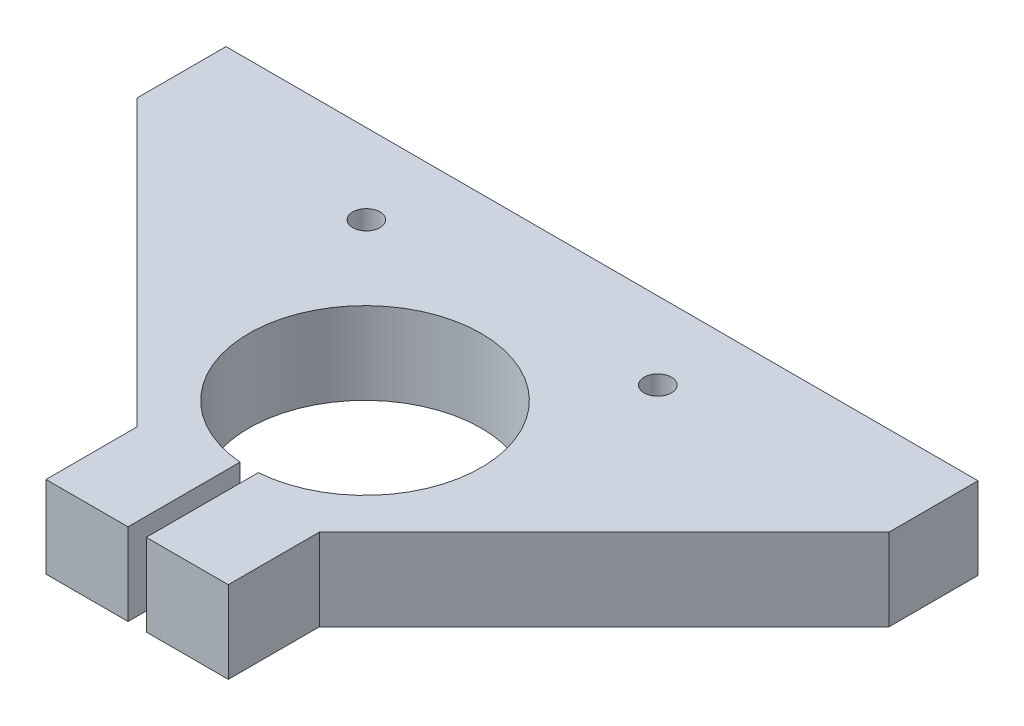
ISO-10303-21;
HEADER;
FILE_DESCRIPTION(('STEP AP214'),'2;1');
FILE_NAME('part.step','',(''),(''),'','','');
FILE_SCHEMA(('AUTOMOTIVE_DESIGN { 1 0 10303 214 1 1 1 1 }'));
ENDSEC;
DATA;
#1=APPLICATION_CONTEXT('core data for automotive mechanical design processes');
#2=APPLICATION_PROTOCOL_DEFINITION('international standard','automotive_design',2000,#1);
#3=PRODUCT_CONTEXT('',#1,'mechanical');
#4=PRODUCT('Part','Part','',(#3));
#5=PRODUCT_RELATED_PRODUCT_CATEGORY('part','',(#4));
#6=PRODUCT_DEFINITION_FORMATION('','',#4);
#7=PRODUCT_DEFINITION_CONTEXT('part definition',#1,'design');
#8=PRODUCT_DEFINITION('design','',#6,#7);
#9=PRODUCT_DEFINITION_SHAPE('','',#8);
#10=(LENGTH_UNIT() NAMED_UNIT(*) SI_UNIT(.MILLI.,.METRE.));
#11=(NAMED_UNIT(*) PLANE_ANGLE_UNIT() SI_UNIT($,.RADIAN.));
#12=(NAMED_UNIT(*) SI_UNIT($,.STERADIAN.) SOLID_ANGLE_UNIT());
#13=UNCERTAINTY_MEASURE_WITH_UNIT(LENGTH_MEASURE(1.E-05),#10,'distance_accuracy_value','');
#14=(GEOMETRIC_REPRESENTATION_CONTEXT(3) GLOBAL_UNCERTAINTY_ASSIGNED_CONTEXT((#13)) GLOBAL_UNIT_ASSIGNED_CONTEXT((#10,
#11,#12)) REPRESENTATION_CONTEXT('',''));
#15=CARTESIAN_POINT('',(0.,0.,0.));
#16=DIRECTION('',(0.,0.,1.));
#17=DIRECTION('',(1.,0.,0.));
#18=AXIS2_PLACEMENT_3D('',#15,#16,#17);
#19=CARTESIAN_POINT('',(-0.62482485548284,18.,40.2736793553215));
#20=DIRECTION('',(0.,-1.,0.));
#21=DIRECTION('',(0.,0.,-1.));
#22=AXIS2_PLACEMENT_3D('',#19,#20,#21);
#23=CYLINDRICAL_SURFACE('',#22,25.5);
#24=CARTESIAN_POINT('',(-0.62482485548284,0.,40.2736793553215));
#25=DIRECTION('',(0.,-1.,0.));
#26=DIRECTION('',(0.,0.,1.));
#27=AXIS2_PLACEMENT_3D('',#24,#25,#26);
#28=CIRCLE('',#27,25.5);
#29=CARTESIAN_POINT('',(-2.62482485548284,0.,65.6951269930938));
#30=VERTEX_POINT('',#29);
#31=CARTESIAN_POINT('',(1.37517514451716,0.,65.6951269930938));
#32=VERTEX_POINT('',#31);
#33=EDGE_CURVE('E154',#30,#32,#28,.T.);
#34=ORIENTED_EDGE('',*,*,#33,.T.);
#35=DIRECTION('',(0.,-1.,0.));
#36=VECTOR('',#35,1.);
#37=CARTESIAN_POINT('',(1.37517514451716,18.,65.6951269930938));
#38=LINE('',#37,#36);
#39=CARTESIAN_POINT('',(1.37517514451716,18.,65.6951269930938));
#40=VERTEX_POINT('',#39);
#41=EDGE_CURVE('E11',#40,#32,#38,.T.);
#42=ORIENTED_EDGE('',*,*,#41,.F.);
#43=CARTESIAN_POINT('',(-0.62482485548284,18.,40.2736793553215));
#44=DIRECTION('',(0.,-1.,0.));
#45=DIRECTION('',(0.,0.,1.));
#46=AXIS2_PLACEMENT_3D('',#43,#44,#45);
#47=CIRCLE('',#46,25.5);
#48=CARTESIAN_POINT('',(-2.62482485548284,18.,65.6951269930938));
#49=VERTEX_POINT('',#48);
#50=EDGE_CURVE('E177',#49,#40,#47,.T.);
#51=ORIENTED_EDGE('',*,*,#50,.F.);
#52=DIRECTION('',(0.,-1.,0.));
#53=VECTOR('',#52,1.);
#54=CARTESIAN_POINT('',(-2.62482485548284,18.,65.6951269930938));
#55=LINE('',#54,#53);
#56=EDGE_CURVE('E150',#49,#30,#55,.T.);
#57=ORIENTED_EDGE('',*,*,#56,.T.);
#58=EDGE_LOOP('',(#34,#42,#51,#57));
#59=FACE_BOUND('',#58,.T.);
#60=ADVANCED_FACE('F34',(#59),#23,.F.);
#61=CARTESIAN_POINT('',(1.37517514451716,18.,90.2736793553215));
#62=DIRECTION('',(1.,0.,0.));
#63=DIRECTION('',(0.,0.,-1.));
#64=AXIS2_PLACEMENT_3D('',#61,#62,#63);
#65=PLANE('',#64);
#66=DIRECTION('',(0.,0.,1.));
#67=VECTOR('',#66,1.);
#68=CARTESIAN_POINT('',(1.37517514451716,0.,90.2736793553215));
#69=LINE('',#68,#67);
#70=CARTESIAN_POINT('',(1.37517514451716,0.,90.2736793553215));
#71=VERTEX_POINT('',#70);
#72=EDGE_CURVE('E157',#32,#71,#69,.T.);
#73=ORIENTED_EDGE('',*,*,#72,.T.);
#74=DIRECTION('',(0.,-1.,0.));
#75=VECTOR('',#74,1.);
#76=CARTESIAN_POINT('',(1.37517514451716,18.,90.2736793553215));
#77=LINE('',#76,#75);
#78=CARTESIAN_POINT('',(1.37517514451716,18.,90.2736793553215));
#79=VERTEX_POINT('',#78);
#80=EDGE_CURVE('E42',#79,#71,#77,.T.);
#81=ORIENTED_EDGE('',*,*,#80,.F.);
#82=DIRECTION('',(0.,0.,1.));
#83=VECTOR('',#82,1.);
#84=CARTESIAN_POINT('',(1.37517514451716,18.,90.2736793553215));
#85=LINE('',#84,#83);
#86=EDGE_CURVE('E105',#40,#79,#85,.T.);
#87=ORIENTED_EDGE('',*,*,#86,.F.);
#88=ORIENTED_EDGE('',*,*,#41,.T.);
#89=EDGE_LOOP('',(#73,#81,#87,#88));
#90=FACE_BOUND('',#89,.T.);
#91=ADVANCED_FACE('F256',(#90),#65,.F.);
#92=CARTESIAN_POINT('',(1.37517514451716,18.,90.2736793553215));
#93=DIRECTION('',(0.,0.,-1.));
#94=DIRECTION('',(-1.,0.,0.));
#95=AXIS2_PLACEMENT_3D('',#92,#93,#94);
#96=PLANE('',#95);
#97=DIRECTION('',(1.,0.,0.));
#98=VECTOR('',#97,1.);
#99=CARTESIAN_POINT('',(1.37517514451716,0.,90.2736793553215));
#100=LINE('',#99,#98);
#101=CARTESIAN_POINT('',(19.375175144517,0.,90.2736793553215));
#102=VERTEX_POINT('',#101);
#103=EDGE_CURVE('E160',#71,#102,#100,.T.);
#104=ORIENTED_EDGE('',*,*,#103,.T.);
#105=DIRECTION('',(0.,-1.,0.));
#106=VECTOR('',#105,1.);
#107=CARTESIAN_POINT('',(19.375175144517,18.,90.2736793553215));
#108=LINE('',#107,#106);
#109=CARTESIAN_POINT('',(19.375175144517,18.,90.2736793553215));
#110=VERTEX_POINT('',#109);
#111=EDGE_CURVE('E196',#110,#102,#108,.T.);
#112=ORIENTED_EDGE('',*,*,#111,.F.);
#113=DIRECTION('',(1.,0.,0.));
#114=VECTOR('',#113,1.);
#115=CARTESIAN_POINT('',(1.37517514451716,18.,90.2736793553215));
#116=LINE('',#115,#114);
#117=EDGE_CURVE('E204',#79,#110,#116,.T.);
#118=ORIENTED_EDGE('',*,*,#117,.F.);
#119=ORIENTED_EDGE('',*,*,#80,.T.);
#120=EDGE_LOOP('',(#104,#112,#118,#119));
#121=FACE_BOUND('',#120,.T.);
#122=ADVANCED_FACE('F202',(#121),#96,.F.);
#123=CARTESIAN_POINT('',(19.375175144517,18.,70.2736793553218));
#124=DIRECTION('',(-1.,0.,0.));
#125=DIRECTION('',(0.,0.,1.));
#126=AXIS2_PLACEMENT_3D('',#123,#124,#125);
#127=PLANE('',#126);
#128=DIRECTION('',(0.,0.,-1.));
#129=VECTOR('',#128,1.);
#130=CARTESIAN_POINT('',(19.375175144517,0.,70.2736793553218));
#131=LINE('',#130,#129);
#132=CARTESIAN_POINT('',(19.375175144517,0.,70.2736793553218));
#133=VERTEX_POINT('',#132);
#134=EDGE_CURVE('E162',#102,#133,#131,.T.);
#135=ORIENTED_EDGE('',*,*,#134,.T.);
#136=DIRECTION('',(0.,-1.,0.));
#137=VECTOR('',#136,1.);
#138=CARTESIAN_POINT('',(19.375175144517,18.,70.2736793553218));
#139=LINE('',#138,#137);
#140=CARTESIAN_POINT('',(19.375175144517,18.,70.2736793553218));
#141=VERTEX_POINT('',#140);
#142=EDGE_CURVE('E193',#141,#133,#139,.T.);
#143=ORIENTED_EDGE('',*,*,#142,.F.);
#144=DIRECTION('',(0.,0.,-1.));
#145=VECTOR('',#144,1.);
#146=CARTESIAN_POINT('',(19.375175144517,18.,70.2736793553218));
#147=LINE('',#146,#145);
#148=EDGE_CURVE('E222',#110,#141,#147,.T.);
#149=ORIENTED_EDGE('',*,*,#148,.F.);
#150=ORIENTED_EDGE('',*,*,#111,.T.);
#151=EDGE_LOOP('',(#135,#143,#149,#150));
#152=FACE_BOUND('',#151,.T.);
#153=ADVANCED_FACE('F213',(#152),#127,.F.);
#154=CARTESIAN_POINT('',(19.375175144517,18.,70.2736793553218));
#155=DIRECTION('',(-0.707106781186547,0.,-0.707106781186548));
#156=DIRECTION('',(-0.707106781186548,0.,0.707106781186547));
#157=AXIS2_PLACEMENT_3D('',#154,#155,#156);
#158=PLANE('',#157);
#159=DIRECTION('',(0.707106781186548,0.,-0.707106781186547));
#160=VECTOR('',#159,1.);
#161=CARTESIAN_POINT('',(19.375175144517,0.,70.2736793553218));
#162=LINE('',#161,#160);
#163=CARTESIAN_POINT('',(81.8751751445169,0.,7.77367935532188));
#164=VERTEX_POINT('',#163);
#165=EDGE_CURVE('E164',#133,#164,#162,.T.);
#166=ORIENTED_EDGE('',*,*,#165,.T.);
#167=DIRECTION('',(0.,-1.,0.));
#168=VECTOR('',#167,1.);
#169=CARTESIAN_POINT('',(81.8751751445169,18.,7.77367935532188));
#170=LINE('',#169,#168);
#171=CARTESIAN_POINT('',(81.8751751445169,18.,7.77367935532188));
#172=VERTEX_POINT('',#171);
#173=EDGE_CURVE('E190',#172,#164,#170,.T.);
#174=ORIENTED_EDGE('',*,*,#173,.F.);
#175=DIRECTION('',(0.707106781186548,0.,-0.707106781186547));
#176=VECTOR('',#175,1.);
#177=CARTESIAN_POINT('',(19.375175144517,18.,70.2736793553218));
#178=LINE('',#177,#176);
#179=EDGE_CURVE('E219',#141,#172,#178,.T.);
#180=ORIENTED_EDGE('',*,*,#179,.F.);
#181=ORIENTED_EDGE('',*,*,#142,.T.);
#182=EDGE_LOOP('',(#166,#174,#180,#181));
#183=FACE_BOUND('',#182,.T.);
#184=ADVANCED_FACE('F217',(#183),#158,.F.);
#185=CARTESIAN_POINT('',(81.8751751445169,18.,-11.7263206446789));
#186=DIRECTION('',(-1.,0.,0.));
#187=DIRECTION('',(0.,0.,1.));
#188=AXIS2_PLACEMENT_3D('',#185,#186,#187);
#189=PLANE('',#188);
#190=DIRECTION('',(0.,0.,-1.));
#191=VECTOR('',#190,1.);
#192=CARTESIAN_POINT('',(81.8751751445169,0.,-11.7263206446789));
#193=LINE('',#192,#191);
#194=CARTESIAN_POINT('',(81.8751751445169,0.,-11.7263206446789));
#195=VERTEX_POINT('',#194);
#196=EDGE_CURVE('E166',#164,#195,#193,.T.);
#197=ORIENTED_EDGE('',*,*,#196,.T.);
#198=DIRECTION('',(0.,-1.,0.));
#199=VECTOR('',#198,1.);
#200=CARTESIAN_POINT('',(81.8751751445169,18.,-11.7263206446789));
#201=LINE('',#200,#199);
#202=CARTESIAN_POINT('',(81.8751751445169,18.,-11.7263206446789));
#203=VERTEX_POINT('',#202);
#204=EDGE_CURVE('E187',#203,#195,#201,.T.);
#205=ORIENTED_EDGE('',*,*,#204,.F.);
#206=DIRECTION('',(0.,0.,-1.));
#207=VECTOR('',#206,1.);
#208=CARTESIAN_POINT('',(81.8751751445169,18.,-11.7263206446789));
#209=LINE('',#208,#207);
#210=EDGE_CURVE('E221',#172,#203,#209,.T.);
#211=ORIENTED_EDGE('',*,*,#210,.F.);
#212=ORIENTED_EDGE('',*,*,#173,.T.);
#213=EDGE_LOOP('',(#197,#205,#211,#212));
#214=FACE_BOUND('',#213,.T.);
#215=ADVANCED_FACE('F269',(#214),#189,.F.);
#216=CARTESIAN_POINT('',(-83.1248248554831,18.,-11.7263206446788));
#217=DIRECTION('',(0.,0.,1.));
#218=DIRECTION('',(1.,0.,0.));
#219=AXIS2_PLACEMENT_3D('',#216,#217,#218);
#220=PLANE('',#219);
#221=DIRECTION('',(-1.,0.,0.));
#222=VECTOR('',#221,1.);
#223=CARTESIAN_POINT('',(-83.1248248554831,0.,-11.7263206446788));
#224=LINE('',#223,#222);
#225=CARTESIAN_POINT('',(-83.1248248554831,0.,-11.7263206446788));
#226=VERTEX_POINT('',#225);
#227=EDGE_CURVE('E168',#195,#226,#224,.T.);
#228=ORIENTED_EDGE('',*,*,#227,.T.);
#229=DIRECTION('',(0.,-1.,0.));
#230=VECTOR('',#229,1.);
#231=CARTESIAN_POINT('',(-83.1248248554831,18.,-11.7263206446788));
#232=LINE('',#231,#230);
#233=CARTESIAN_POINT('',(-83.1248248554831,18.,-11.7263206446788));
#234=VERTEX_POINT('',#233);
#235=EDGE_CURVE('E184',#234,#226,#232,.T.);
#236=ORIENTED_EDGE('',*,*,#235,.F.);
#237=DIRECTION('',(-1.,0.,0.));
#238=VECTOR('',#237,1.);
#239=CARTESIAN_POINT('',(-83.1248248554831,18.,-11.7263206446788));
#240=LINE('',#239,#238);
#241=EDGE_CURVE('E224',#203,#234,#240,.T.);
#242=ORIENTED_EDGE('',*,*,#241,.F.);
#243=ORIENTED_EDGE('',*,*,#204,.T.);
#244=EDGE_LOOP('',(#228,#236,#242,#243));
#245=FACE_BOUND('',#244,.T.);
#246=ADVANCED_FACE('F272',(#245),#220,.F.);
#247=CARTESIAN_POINT('',(-83.1248248554831,18.,-11.7263206446788));
#248=DIRECTION('',(1.,0.,0.));
#249=DIRECTION('',(0.,0.,-1.));
#250=AXIS2_PLACEMENT_3D('',#247,#248,#249);
#251=PLANE('',#250);
#252=DIRECTION('',(0.,0.,1.));
#253=VECTOR('',#252,1.);
#254=CARTESIAN_POINT('',(-83.1248248554831,0.,-11.7263206446788));
#255=LINE('',#254,#253);
#256=CARTESIAN_POINT('',(-83.1248248554831,0.,7.77367935532199));
#257=VERTEX_POINT('',#256);
#258=EDGE_CURVE('E170',#226,#257,#255,.T.);
#259=ORIENTED_EDGE('',*,*,#258,.T.);
#260=DIRECTION('',(0.,-1.,0.));
#261=VECTOR('',#260,1.);
#262=CARTESIAN_POINT('',(-83.1248248554831,18.,7.77367935532199));
#263=LINE('',#262,#261);
#264=CARTESIAN_POINT('',(-83.1248248554831,18.,7.77367935532199));
#265=VERTEX_POINT('',#264);
#266=EDGE_CURVE('E181',#265,#257,#263,.T.);
#267=ORIENTED_EDGE('',*,*,#266,.F.);
#268=DIRECTION('',(0.,0.,1.));
#269=VECTOR('',#268,1.);
#270=CARTESIAN_POINT('',(-83.1248248554831,18.,-11.7263206446788));
#271=LINE('',#270,#269);
#272=EDGE_CURVE('E230',#234,#265,#271,.T.);
#273=ORIENTED_EDGE('',*,*,#272,.F.);
#274=ORIENTED_EDGE('',*,*,#235,.T.);
#275=EDGE_LOOP('',(#259,#267,#273,#274));
#276=FACE_BOUND('',#275,.T.);
#277=ADVANCED_FACE('F236',(#276),#251,.F.);
#278=CARTESIAN_POINT('',(-83.1248248554831,18.,7.77367935532199));
#279=DIRECTION('',(0.707106781186543,0.,-0.707106781186552));
#280=DIRECTION('',(-0.707106781186552,0.,-0.707106781186543));
#281=AXIS2_PLACEMENT_3D('',#278,#279,#280);
#282=PLANE('',#281);
#283=DIRECTION('',(0.707106781186552,0.,0.707106781186543));
#284=VECTOR('',#283,1.);
#285=CARTESIAN_POINT('',(-83.1248248554831,0.,7.77367935532199));
#286=LINE('',#285,#284);
#287=CARTESIAN_POINT('',(-20.6248248554827,0.,70.2736793553215));
#288=VERTEX_POINT('',#287);
#289=EDGE_CURVE('E172',#257,#288,#286,.T.);
#290=ORIENTED_EDGE('',*,*,#289,.T.);
#291=DIRECTION('',(0.,-1.,0.));
#292=VECTOR('',#291,1.);
#293=CARTESIAN_POINT('',(-20.6248248554827,18.,70.2736793553215));
#294=LINE('',#293,#292);
#295=CARTESIAN_POINT('',(-20.6248248554827,18.,70.2736793553215));
#296=VERTEX_POINT('',#295);
#297=EDGE_CURVE('E145',#296,#288,#294,.T.);
#298=ORIENTED_EDGE('',*,*,#297,.F.);
#299=DIRECTION('',(0.707106781186552,0.,0.707106781186543));
#300=VECTOR('',#299,1.);
#301=CARTESIAN_POINT('',(-83.1248248554831,18.,7.77367935532199));
#302=LINE('',#301,#300);
#303=EDGE_CURVE('E136',#265,#296,#302,.T.);
#304=ORIENTED_EDGE('',*,*,#303,.F.);
#305=ORIENTED_EDGE('',*,*,#266,.T.);
#306=EDGE_LOOP('',(#290,#298,#304,#305));
#307=FACE_BOUND('',#306,.T.);
#308=ADVANCED_FACE('F240',(#307),#282,.F.);
#309=CARTESIAN_POINT('',(-20.6248248554827,18.,70.2736793553215));
#310=DIRECTION('',(1.,0.,0.));
#311=DIRECTION('',(0.,0.,-1.));
#312=AXIS2_PLACEMENT_3D('',#309,#310,#311);
#313=PLANE('',#312);
#314=DIRECTION('',(0.,0.,1.));
#315=VECTOR('',#314,1.);
#316=CARTESIAN_POINT('',(-20.6248248554827,0.,70.2736793553215));
#317=LINE('',#316,#315);
#318=CARTESIAN_POINT('',(-20.6248248554828,0.,90.2736793553215));
#319=VERTEX_POINT('',#318);
#320=EDGE_CURVE('E144',#288,#319,#317,.T.);
#321=ORIENTED_EDGE('',*,*,#320,.T.);
#322=DIRECTION('',(0.,-1.,0.));
#323=VECTOR('',#322,1.);
#324=CARTESIAN_POINT('',(-20.6248248554828,18.,90.2736793553215));
#325=LINE('',#324,#323);
#326=CARTESIAN_POINT('',(-20.6248248554828,18.,90.2736793553215));
#327=VERTEX_POINT('',#326);
#328=EDGE_CURVE('E141',#327,#319,#325,.T.);
#329=ORIENTED_EDGE('',*,*,#328,.F.);
#330=DIRECTION('',(0.,0.,1.));
#331=VECTOR('',#330,1.);
#332=CARTESIAN_POINT('',(-20.6248248554827,18.,70.2736793553215));
#333=LINE('',#332,#331);
#334=EDGE_CURVE('E130',#296,#327,#333,.T.);
#335=ORIENTED_EDGE('',*,*,#334,.F.);
#336=ORIENTED_EDGE('',*,*,#297,.T.);
#337=EDGE_LOOP('',(#321,#329,#335,#336));
#338=FACE_BOUND('',#337,.T.);
#339=ADVANCED_FACE('F142',(#338),#313,.F.);
#340=CARTESIAN_POINT('',(-20.6248248554828,18.,90.2736793553215));
#341=DIRECTION('',(0.,0.,-1.));
#342=DIRECTION('',(-1.,0.,0.));
#343=AXIS2_PLACEMENT_3D('',#340,#341,#342);
#344=PLANE('',#343);
#345=DIRECTION('',(1.,0.,0.));
#346=VECTOR('',#345,1.);
#347=CARTESIAN_POINT('',(-20.6248248554828,0.,90.2736793553215));
#348=LINE('',#347,#346);
#349=CARTESIAN_POINT('',(-2.62482485548284,0.,90.2736793553215));
#350=VERTEX_POINT('',#349);
#351=EDGE_CURVE('E91',#319,#350,#348,.T.);
#352=ORIENTED_EDGE('',*,*,#351,.T.);
#353=DIRECTION('',(0.,-1.,0.));
#354=VECTOR('',#353,1.);
#355=CARTESIAN_POINT('',(-2.62482485548284,18.,90.2736793553215));
#356=LINE('',#355,#354);
#357=CARTESIAN_POINT('',(-2.62482485548284,18.,90.2736793553215));
#358=VERTEX_POINT('',#357);
#359=EDGE_CURVE('E146',#358,#350,#356,.T.);
#360=ORIENTED_EDGE('',*,*,#359,.F.);
#361=DIRECTION('',(1.,0.,0.));
#362=VECTOR('',#361,1.);
#363=CARTESIAN_POINT('',(-20.6248248554828,18.,90.2736793553215));
#364=LINE('',#363,#362);
#365=EDGE_CURVE('E134',#327,#358,#364,.T.);
#366=ORIENTED_EDGE('',*,*,#365,.F.);
#367=ORIENTED_EDGE('',*,*,#328,.T.);
#368=EDGE_LOOP('',(#352,#360,#366,#367));
#369=FACE_BOUND('',#368,.T.);
#370=ADVANCED_FACE('F148',(#369),#344,.F.);
#371=CARTESIAN_POINT('',(-2.62482485548284,18.,90.2736793553215));
#372=DIRECTION('',(-1.,0.,0.));
#373=DIRECTION('',(0.,0.,1.));
#374=AXIS2_PLACEMENT_3D('',#371,#372,#373);
#375=PLANE('',#374);
#376=DIRECTION('',(0.,0.,-1.));
#377=VECTOR('',#376,1.);
#378=CARTESIAN_POINT('',(-2.62482485548284,0.,90.2736793553215));
#379=LINE('',#378,#377);
#380=EDGE_CURVE('E97',#350,#30,#379,.T.);
#381=ORIENTED_EDGE('',*,*,#380,.T.);
#382=ORIENTED_EDGE('',*,*,#56,.F.);
#383=DIRECTION('',(0.,0.,-1.));
#384=VECTOR('',#383,1.);
#385=CARTESIAN_POINT('',(-2.62482485548284,18.,90.2736793553215));
#386=LINE('',#385,#384);
#387=EDGE_CURVE('E50',#358,#49,#386,.T.);
#388=ORIENTED_EDGE('',*,*,#387,.F.);
#389=ORIENTED_EDGE('',*,*,#359,.T.);
#390=EDGE_LOOP('',(#381,#382,#388,#389));
#391=FACE_BOUND('',#390,.T.);
#392=ADVANCED_FACE('F244',(#391),#375,.F.);
#393=CARTESIAN_POINT('',(-0.62482485548284,18.,40.2736793553215));
#394=DIRECTION('',(0.,1.,0.));
#395=DIRECTION('',(0.,0.,1.));
#396=AXIS2_PLACEMENT_3D('',#393,#394,#395);
#397=PLANE('',#396);
#398=CARTESIAN_POINT('',(-34.8169284840513,18.,5.785627569099));
#399=DIRECTION('',(0.,1.,0.));
#400=DIRECTION('',(0.,0.,1.));
#401=AXIS2_PLACEMENT_3D('',#398,#399,#400);
#402=CIRCLE('',#401,2.99999999999999);
#403=CARTESIAN_POINT('',(-34.8169284840513,18.,8.78562756909899));
#404=VERTEX_POINT('',#403);
#405=EDGE_CURVE('E340',#404,#404,#402,.T.);
#406=ORIENTED_EDGE('',*,*,#405,.F.);
#407=EDGE_LOOP('',(#406));
#408=FACE_BOUND('',#407,.T.);
#409=CARTESIAN_POINT('',(28.5542290037577,18.,5.21642555573545));
#410=DIRECTION('',(0.,1.,0.));
#411=DIRECTION('',(0.,0.,1.));
#412=AXIS2_PLACEMENT_3D('',#409,#410,#411);
#413=CIRCLE('',#412,2.99999999999999);
#414=CARTESIAN_POINT('',(28.5542290037577,18.,8.21642555573544));
#415=VERTEX_POINT('',#414);
#416=EDGE_CURVE('E342',#415,#415,#413,.T.);
#417=ORIENTED_EDGE('',*,*,#416,.F.);
#418=EDGE_LOOP('',(#417));
#419=FACE_BOUND('',#418,.T.);
#420=ORIENTED_EDGE('',*,*,#50,.T.);
#421=ORIENTED_EDGE('',*,*,#86,.T.);
#422=ORIENTED_EDGE('',*,*,#117,.T.);
#423=ORIENTED_EDGE('',*,*,#148,.T.);
#424=ORIENTED_EDGE('',*,*,#179,.T.);
#425=ORIENTED_EDGE('',*,*,#210,.T.);
#426=ORIENTED_EDGE('',*,*,#241,.T.);
#427=ORIENTED_EDGE('',*,*,#272,.T.);
#428=ORIENTED_EDGE('',*,*,#303,.T.);
#429=ORIENTED_EDGE('',*,*,#334,.T.);
#430=ORIENTED_EDGE('',*,*,#365,.T.);
#431=ORIENTED_EDGE('',*,*,#387,.T.);
#432=EDGE_LOOP('',(#420,#421,#422,#423,#424,#425,#426,#427,#428,#429,#430,#431));
#433=FACE_BOUND('',#432,.T.);
#434=ADVANCED_FACE('F132',(#408,#419,#433),#397,.T.);
#435=CARTESIAN_POINT('',(-0.62482485548284,0.,40.2736793553215));
#436=DIRECTION('',(0.,1.,0.));
#437=DIRECTION('',(0.,0.,1.));
#438=AXIS2_PLACEMENT_3D('',#435,#436,#437);
#439=PLANE('',#438);
#440=CARTESIAN_POINT('',(-34.8169284840513,0.,5.785627569099));
#441=DIRECTION('',(0.,1.,0.));
#442=DIRECTION('',(0.,0.,1.));
#443=AXIS2_PLACEMENT_3D('',#440,#441,#442);
#444=CIRCLE('',#443,3.);
#445=CARTESIAN_POINT('',(-34.8169284840513,0.,8.785627569099));
#446=VERTEX_POINT('',#445);
#447=EDGE_CURVE('E337',#446,#446,#444,.T.);
#448=ORIENTED_EDGE('',*,*,#447,.T.);
#449=EDGE_LOOP('',(#448));
#450=FACE_BOUND('',#449,.T.);
#451=CARTESIAN_POINT('',(28.5542290037577,0.,5.21642555573545));
#452=DIRECTION('',(0.,1.,0.));
#453=DIRECTION('',(0.,0.,1.));
#454=AXIS2_PLACEMENT_3D('',#451,#452,#453);
#455=CIRCLE('',#454,3.);
#456=CARTESIAN_POINT('',(28.5542290037577,0.,8.21642555573545));
#457=VERTEX_POINT('',#456);
#458=EDGE_CURVE('E158',#457,#457,#455,.T.);
#459=ORIENTED_EDGE('',*,*,#458,.T.);
#460=EDGE_LOOP('',(#459));
#461=FACE_BOUND('',#460,.T.);
#462=ORIENTED_EDGE('',*,*,#33,.F.);
#463=ORIENTED_EDGE('',*,*,#380,.F.);
#464=ORIENTED_EDGE('',*,*,#351,.F.);
#465=ORIENTED_EDGE('',*,*,#320,.F.);
#466=ORIENTED_EDGE('',*,*,#289,.F.);
#467=ORIENTED_EDGE('',*,*,#258,.F.);
#468=ORIENTED_EDGE('',*,*,#227,.F.);
#469=ORIENTED_EDGE('',*,*,#196,.F.);
#470=ORIENTED_EDGE('',*,*,#165,.F.);
#471=ORIENTED_EDGE('',*,*,#134,.F.);
#472=ORIENTED_EDGE('',*,*,#103,.F.);
#473=ORIENTED_EDGE('',*,*,#72,.F.);
#474=EDGE_LOOP('',(#462,#463,#464,#465,#466,#467,#468,#469,#470,#471,#472,#473));
#475=FACE_BOUND('',#474,.T.);
#476=ADVANCED_FACE('F208',(#450,#461,#475),#439,.F.);
#477=CARTESIAN_POINT('',(28.5542290037577,18.,5.21642555573545));
#478=DIRECTION('',(0.,1.,0.));
#479=DIRECTION('',(0.,0.,1.));
#480=AXIS2_PLACEMENT_3D('',#477,#478,#479);
#481=CYLINDRICAL_SURFACE('',#480,2.99999999999999);
#482=ORIENTED_EDGE('',*,*,#458,.F.);
#483=EDGE_LOOP('',(#482));
#484=FACE_BOUND('',#483,.T.);
#485=ORIENTED_EDGE('',*,*,#416,.T.);
#486=EDGE_LOOP('',(#485));
#487=FACE_BOUND('',#486,.T.);
#488=ADVANCED_FACE('F311',(#484,#487),#481,.F.);
#489=CARTESIAN_POINT('',(-34.8169284840513,18.,5.785627569099));
#490=DIRECTION('',(0.,1.,0.));
#491=DIRECTION('',(0.,0.,1.));
#492=AXIS2_PLACEMENT_3D('',#489,#490,#491);
#493=CYLINDRICAL_SURFACE('',#492,2.99999999999999);
#494=ORIENTED_EDGE('',*,*,#447,.F.);
#495=EDGE_LOOP('',(#494));
#496=FACE_BOUND('',#495,.T.);
#497=ORIENTED_EDGE('',*,*,#405,.T.);
#498=EDGE_LOOP('',(#497));
#499=FACE_BOUND('',#498,.T.);
#500=ADVANCED_FACE('F320',(#496,#499),#493,.F.);
#501=CLOSED_SHELL('',(#60,#91,#122,#153,#184,#215,#246,#277,#308,#339,#370,#392,#434,#476,#488,#500));
#502=MANIFOLD_SOLID_BREP('B2',#501);
#503=ADVANCED_BREP_SHAPE_REPRESENTATION('',(#18,#502),#14);
#504=SHAPE_DEFINITION_REPRESENTATION(#9,#503);
ENDSEC;
END-ISO-10303-21;
